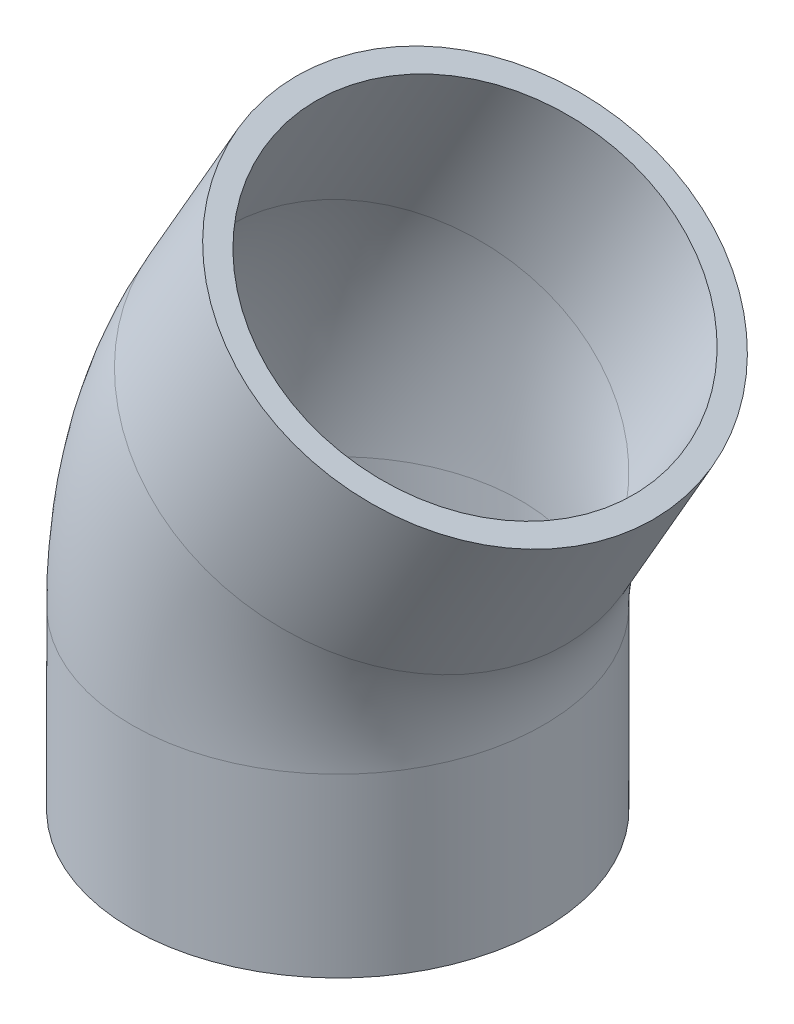
ISO-10303-21;
HEADER;
FILE_DESCRIPTION(('STEP AP214'),'2;1');
FILE_NAME('part.step','',(''),(''),'','','');
FILE_SCHEMA(('AUTOMOTIVE_DESIGN { 1 0 10303 214 1 1 1 1 }'));
ENDSEC;
DATA;
#1=APPLICATION_CONTEXT('core data for automotive mechanical design processes');
#2=APPLICATION_PROTOCOL_DEFINITION('international standard','automotive_design',2000,#1);
#3=PRODUCT_CONTEXT('',#1,'mechanical');
#4=PRODUCT('Part','Part','',(#3));
#5=PRODUCT_RELATED_PRODUCT_CATEGORY('part','',(#4));
#6=PRODUCT_DEFINITION_FORMATION('','',#4);
#7=PRODUCT_DEFINITION_CONTEXT('part definition',#1,'design');
#8=PRODUCT_DEFINITION('design','',#6,#7);
#9=PRODUCT_DEFINITION_SHAPE('','',#8);
#10=(LENGTH_UNIT() NAMED_UNIT(*) SI_UNIT(.MILLI.,.METRE.));
#11=(NAMED_UNIT(*) PLANE_ANGLE_UNIT() SI_UNIT($,.RADIAN.));
#12=(NAMED_UNIT(*) SI_UNIT($,.STERADIAN.) SOLID_ANGLE_UNIT());
#13=UNCERTAINTY_MEASURE_WITH_UNIT(LENGTH_MEASURE(1.E-05),#10,'distance_accuracy_value','');
#14=(GEOMETRIC_REPRESENTATION_CONTEXT(3) GLOBAL_UNCERTAINTY_ASSIGNED_CONTEXT((#13)) GLOBAL_UNIT_ASSIGNED_CONTEXT((#10,
#11,#12)) REPRESENTATION_CONTEXT('',''));
#15=CARTESIAN_POINT('',(0.,0.,0.));
#16=DIRECTION('',(0.,0.,1.));
#17=DIRECTION('',(1.,0.,0.));
#18=AXIS2_PLACEMENT_3D('',#15,#16,#17);
#19=CARTESIAN_POINT('',(0.,0.,0.));
#20=DIRECTION('',(0.,1.,0.));
#21=DIRECTION('',(0.,0.,1.));
#22=AXIS2_PLACEMENT_3D('',#19,#20,#21);
#23=PLANE('',#22);
#24=CARTESIAN_POINT('',(0.,0.,0.));
#25=DIRECTION('',(0.,1.,0.));
#26=DIRECTION('',(0.,0.,1.));
#27=AXIS2_PLACEMENT_3D('',#24,#25,#26);
#28=CIRCLE('',#27,20.);
#29=CARTESIAN_POINT('',(0.,0.,20.));
#30=VERTEX_POINT('',#29);
#31=EDGE_CURVE('E66',#30,#30,#28,.T.);
#32=ORIENTED_EDGE('',*,*,#31,.T.);
#33=EDGE_LOOP('',(#32));
#34=FACE_BOUND('',#33,.T.);
#35=CARTESIAN_POINT('',(0.,0.,0.));
#36=DIRECTION('',(0.,1.,0.));
#37=DIRECTION('',(0.,0.,1.));
#38=AXIS2_PLACEMENT_3D('',#35,#36,#37);
#39=CIRCLE('',#38,22.5);
#40=CARTESIAN_POINT('',(0.,0.,22.5));
#41=VERTEX_POINT('',#40);
#42=EDGE_CURVE('E49',#41,#41,#39,.T.);
#43=ORIENTED_EDGE('',*,*,#42,.F.);
#44=EDGE_LOOP('',(#43));
#45=FACE_BOUND('',#44,.T.);
#46=ADVANCED_FACE('F33',(#34,#45),#23,.F.);
#47=CARTESIAN_POINT('',(15.,55.9807621135331,0.));
#48=DIRECTION('',(0.500000000000001,0.866025403784438,0.));
#49=DIRECTION('',(0.,0.,1.));
#50=AXIS2_PLACEMENT_3D('',#47,#48,#49);
#51=PLANE('',#50);
#52=CARTESIAN_POINT('',(15.,55.9807621135331,0.));
#53=DIRECTION('',(0.500000000000001,0.866025403784438,0.));
#54=DIRECTION('',(0.,0.,1.));
#55=AXIS2_PLACEMENT_3D('',#52,#53,#54);
#56=CIRCLE('',#55,20.);
#57=CARTESIAN_POINT('',(15.,55.9807621135331,20.));
#58=VERTEX_POINT('',#57);
#59=EDGE_CURVE('E53',#58,#58,#56,.T.);
#60=ORIENTED_EDGE('',*,*,#59,.F.);
#61=EDGE_LOOP('',(#60));
#62=FACE_BOUND('',#61,.T.);
#63=CARTESIAN_POINT('',(15.,55.9807621135331,0.));
#64=DIRECTION('',(0.500000000000001,0.866025403784438,0.));
#65=DIRECTION('',(-0.866025403784438,0.500000000000001,0.));
#66=AXIS2_PLACEMENT_3D('',#63,#64,#65);
#67=CIRCLE('',#66,22.5);
#68=CARTESIAN_POINT('',(-4.48557158514982,67.2307621135332,0.));
#69=VERTEX_POINT('',#68);
#70=EDGE_CURVE('E10',#69,#69,#67,.T.);
#71=ORIENTED_EDGE('',*,*,#70,.T.);
#72=EDGE_LOOP('',(#71));
#73=FACE_BOUND('',#72,.T.);
#74=ADVANCED_FACE('F89',(#62,#73),#51,.T.);
#75=CARTESIAN_POINT('',(0.,0.,0.));
#76=DIRECTION('',(0.,1.,0.));
#77=DIRECTION('',(0.,0.,1.));
#78=AXIS2_PLACEMENT_3D('',#75,#76,#77);
#79=CYLINDRICAL_SURFACE('',#78,22.5);
#80=CARTESIAN_POINT('',(0.,19.2820323027551,0.));
#81=DIRECTION('',(0.,-1.,0.));
#82=DIRECTION('',(0.,0.,-1.));
#83=AXIS2_PLACEMENT_3D('',#80,#81,#82);
#84=CIRCLE('',#83,22.5);
#85=CARTESIAN_POINT('',(-22.5,19.2820323027551,0.));
#86=VERTEX_POINT('',#85);
#87=EDGE_CURVE('E44',#86,#86,#84,.F.);
#88=ORIENTED_EDGE('',*,*,#87,.F.);
#89=EDGE_LOOP('',(#88));
#90=FACE_BOUND('',#89,.T.);
#91=ORIENTED_EDGE('',*,*,#42,.T.);
#92=EDGE_LOOP('',(#91));
#93=FACE_BOUND('',#92,.T.);
#94=ADVANCED_FACE('F92',(#90,#93),#79,.T.);
#95=CARTESIAN_POINT('',(40.,19.2820323027551,0.));
#96=DIRECTION('',(0.,0.,-1.));
#97=DIRECTION('',(-1.,0.,0.));
#98=AXIS2_PLACEMENT_3D('',#95,#96,#97);
#99=TOROIDAL_SURFACE('',#98,40.,22.5);
#100=CARTESIAN_POINT('',(5.35898384862248,39.2820323027551,0.));
#101=DIRECTION('',(0.500000000000001,0.866025403784438,0.));
#102=DIRECTION('',(-0.866025403784438,0.500000000000001,0.));
#103=AXIS2_PLACEMENT_3D('',#100,#101,#102);
#104=CIRCLE('',#103,22.5);
#105=CARTESIAN_POINT('',(-14.1265877365274,50.5320323027551,0.));
#106=VERTEX_POINT('',#105);
#107=EDGE_CURVE('E40',#106,#106,#104,.T.);
#108=CARTESIAN_POINT('',(40.,19.2820323027551,0.));
#109=DIRECTION('',(0.,0.,-1.));
#110=DIRECTION('',(-1.,0.,0.));
#111=AXIS2_PLACEMENT_3D('',#108,#109,#110);
#112=CIRCLE('',#111,62.5);
#113=EDGE_CURVE('',#86,#106,#112,.T.);
#114=ORIENTED_EDGE('',*,*,#87,.T.);
#115=ORIENTED_EDGE('',*,*,#107,.F.);
#116=ORIENTED_EDGE('',*,*,#113,.T.);
#117=ORIENTED_EDGE('',*,*,#113,.F.);
#118=EDGE_LOOP('',(#114,#116,#115,#117));
#119=FACE_BOUND('',#118,.T.);
#120=ADVANCED_FACE('F84',(#119),#99,.T.);
#121=CARTESIAN_POINT('',(5.35898384862248,39.2820323027551,0.));
#122=DIRECTION('',(0.500000000000001,0.866025403784438,0.));
#123=DIRECTION('',(-0.866025403784438,0.500000000000001,0.));
#124=AXIS2_PLACEMENT_3D('',#121,#122,#123);
#125=CYLINDRICAL_SURFACE('',#124,22.5);
#126=ORIENTED_EDGE('',*,*,#70,.F.);
#127=EDGE_LOOP('',(#126));
#128=FACE_BOUND('',#127,.T.);
#129=ORIENTED_EDGE('',*,*,#107,.T.);
#130=EDGE_LOOP('',(#129));
#131=FACE_BOUND('',#130,.T.);
#132=ADVANCED_FACE('F35',(#128,#131),#125,.T.);
#133=CARTESIAN_POINT('',(0.,0.,0.));
#134=DIRECTION('',(0.,1.,0.));
#135=DIRECTION('',(0.,0.,1.));
#136=AXIS2_PLACEMENT_3D('',#133,#134,#135);
#137=CYLINDRICAL_SURFACE('',#136,20.);
#138=CARTESIAN_POINT('',(0.,19.2820323027551,0.));
#139=DIRECTION('',(0.,1.,0.));
#140=DIRECTION('',(0.,0.,1.));
#141=AXIS2_PLACEMENT_3D('',#138,#139,#140);
#142=CIRCLE('',#141,20.);
#143=CARTESIAN_POINT('',(-20.,19.2820323027551,0.));
#144=VERTEX_POINT('',#143);
#145=EDGE_CURVE('E61',#144,#144,#142,.T.);
#146=ORIENTED_EDGE('',*,*,#145,.T.);
#147=EDGE_LOOP('',(#146));
#148=FACE_BOUND('',#147,.T.);
#149=ORIENTED_EDGE('',*,*,#31,.F.);
#150=EDGE_LOOP('',(#149));
#151=FACE_BOUND('',#150,.T.);
#152=ADVANCED_FACE('F72',(#148,#151),#137,.F.);
#153=CARTESIAN_POINT('',(40.,19.2820323027551,0.));
#154=DIRECTION('',(0.,0.,-1.));
#155=DIRECTION('',(-1.,0.,0.));
#156=AXIS2_PLACEMENT_3D('',#153,#154,#155);
#157=TOROIDAL_SURFACE('',#156,40.,20.);
#158=CARTESIAN_POINT('',(5.35898384862248,39.2820323027551,0.));
#159=DIRECTION('',(0.500000000000001,0.866025403784438,0.));
#160=DIRECTION('',(0.,0.,1.));
#161=AXIS2_PLACEMENT_3D('',#158,#159,#160);
#162=CIRCLE('',#161,20.);
#163=CARTESIAN_POINT('',(-11.9615242270663,49.2820323027551,0.));
#164=VERTEX_POINT('',#163);
#165=EDGE_CURVE('E57',#164,#164,#162,.T.);
#166=CARTESIAN_POINT('',(40.,19.2820323027551,0.));
#167=DIRECTION('',(0.,0.,-1.));
#168=DIRECTION('',(-1.,0.,0.));
#169=AXIS2_PLACEMENT_3D('',#166,#167,#168);
#170=CIRCLE('',#169,60.);
#171=EDGE_CURVE('',#144,#164,#170,.T.);
#172=ORIENTED_EDGE('',*,*,#145,.F.);
#173=ORIENTED_EDGE('',*,*,#165,.T.);
#174=ORIENTED_EDGE('',*,*,#171,.T.);
#175=ORIENTED_EDGE('',*,*,#171,.F.);
#176=EDGE_LOOP('',(#172,#174,#173,#175));
#177=FACE_BOUND('',#176,.T.);
#178=ADVANCED_FACE('F74',(#177),#157,.F.);
#179=CARTESIAN_POINT('',(5.35898384862248,39.2820323027551,0.));
#180=DIRECTION('',(0.500000000000001,0.866025403784438,0.));
#181=DIRECTION('',(-0.866025403784438,0.500000000000001,0.));
#182=AXIS2_PLACEMENT_3D('',#179,#180,#181);
#183=CYLINDRICAL_SURFACE('',#182,20.);
#184=ORIENTED_EDGE('',*,*,#59,.T.);
#185=EDGE_LOOP('',(#184));
#186=FACE_BOUND('',#185,.T.);
#187=ORIENTED_EDGE('',*,*,#165,.F.);
#188=EDGE_LOOP('',(#187));
#189=FACE_BOUND('',#188,.T.);
#190=ADVANCED_FACE('F81',(#186,#189),#183,.F.);
#191=CLOSED_SHELL('',(#46,#74,#94,#120,#132,#152,#178,#190));
#192=MANIFOLD_SOLID_BREP('B2',#191);
#193=ADVANCED_BREP_SHAPE_REPRESENTATION('',(#18,#192),#14);
#194=SHAPE_DEFINITION_REPRESENTATION(#9,#193);
ENDSEC;
END-ISO-10303-21;
